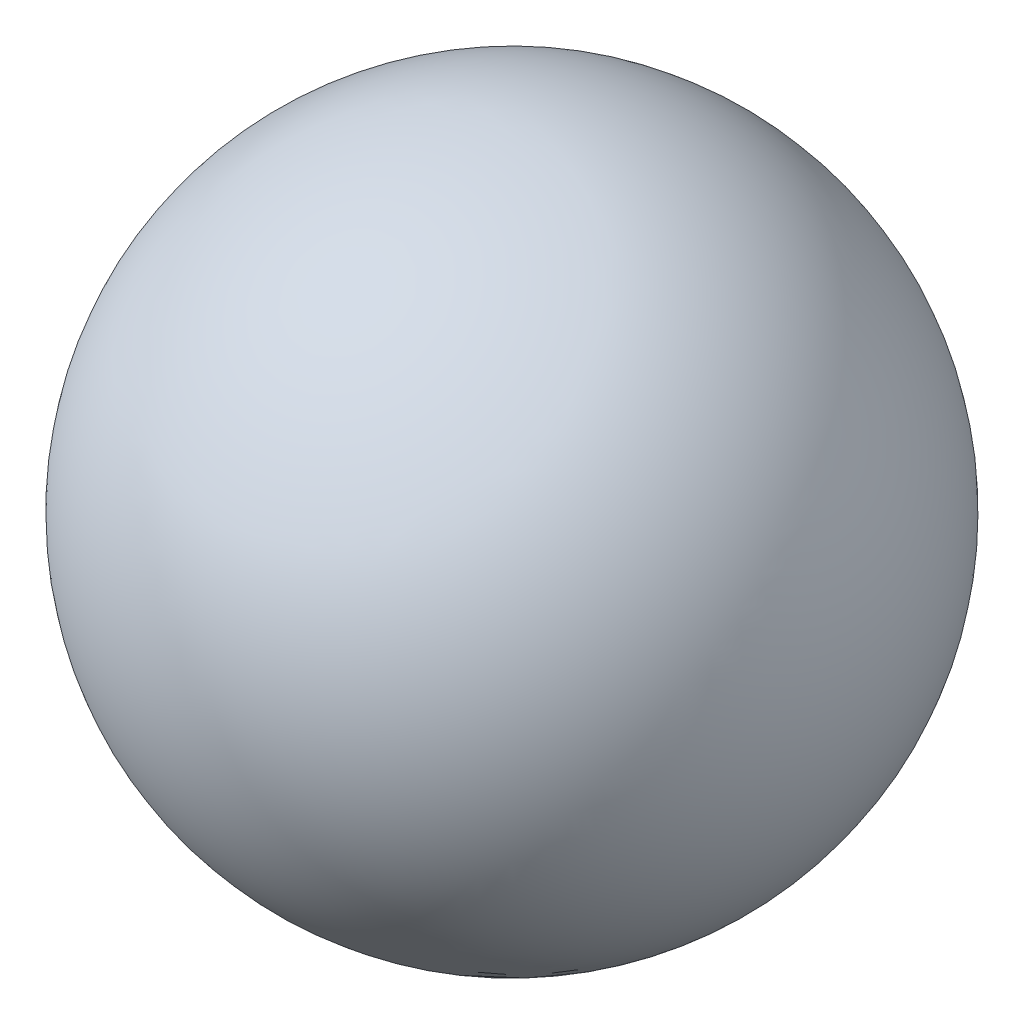
ISO-10303-21;
HEADER;
FILE_DESCRIPTION(('STEP AP214'),'2;1');
FILE_NAME('part.step','',(''),(''),'','','');
FILE_SCHEMA(('AUTOMOTIVE_DESIGN { 1 0 10303 214 1 1 1 1 }'));
ENDSEC;
DATA;
#1=APPLICATION_CONTEXT('core data for automotive mechanical design processes');
#2=APPLICATION_PROTOCOL_DEFINITION('international standard','automotive_design',2000,#1);
#3=PRODUCT_CONTEXT('',#1,'mechanical');
#4=PRODUCT('Part','Part','',(#3));
#5=PRODUCT_RELATED_PRODUCT_CATEGORY('part','',(#4));
#6=PRODUCT_DEFINITION_FORMATION('','',#4);
#7=PRODUCT_DEFINITION_CONTEXT('part definition',#1,'design');
#8=PRODUCT_DEFINITION('design','',#6,#7);
#9=PRODUCT_DEFINITION_SHAPE('','',#8);
#10=(LENGTH_UNIT() NAMED_UNIT(*) SI_UNIT(.MILLI.,.METRE.));
#11=(NAMED_UNIT(*) PLANE_ANGLE_UNIT() SI_UNIT($,.RADIAN.));
#12=(NAMED_UNIT(*) SI_UNIT($,.STERADIAN.) SOLID_ANGLE_UNIT());
#13=UNCERTAINTY_MEASURE_WITH_UNIT(LENGTH_MEASURE(1.E-05),#10,'distance_accuracy_value','');
#14=(GEOMETRIC_REPRESENTATION_CONTEXT(3) GLOBAL_UNCERTAINTY_ASSIGNED_CONTEXT((#13)) GLOBAL_UNIT_ASSIGNED_CONTEXT((#10,
#11,#12)) REPRESENTATION_CONTEXT('',''));
#15=CARTESIAN_POINT('',(0.,0.,0.));
#16=DIRECTION('',(0.,0.,1.));
#17=DIRECTION('',(1.,0.,0.));
#18=AXIS2_PLACEMENT_3D('',#15,#16,#17);
#19=CARTESIAN_POINT('',(0.,0.,0.));
#20=DIRECTION('',(0.734688538449387,0.267366551249673,0.623496494572311));
#21=DIRECTION('',(0.190167382275229,-0.963380783831528,0.189033944207748));
#22=AXIS2_PLACEMENT_3D('',#19,#20,#21);
#23=SPHERICAL_SURFACE('',#22,0.794);
#24=CARTESIAN_POINT('',(-0.583342699528814,-0.21228904169224,-0.495056216690415));
#25=VERTEX_POINT('',#24);
#26=VERTEX_LOOP('',#25);
#27=FACE_BOUND('',#26,.T.);
#28=CARTESIAN_POINT('',(0.583342699528813,0.212289041692241,0.495056216690415));
#29=VERTEX_POINT('',#28);
#30=VERTEX_LOOP('',#29);
#31=FACE_BOUND('',#30,.T.);
#32=ADVANCED_FACE('F15',(#27,#31),#23,.T.);
#33=CLOSED_SHELL('',(#32));
#34=MANIFOLD_SOLID_BREP('B1',#33);
#35=ADVANCED_BREP_SHAPE_REPRESENTATION('',(#18,#34),#14);
#36=SHAPE_DEFINITION_REPRESENTATION(#9,#35);
ENDSEC;
END-ISO-10303-21;
